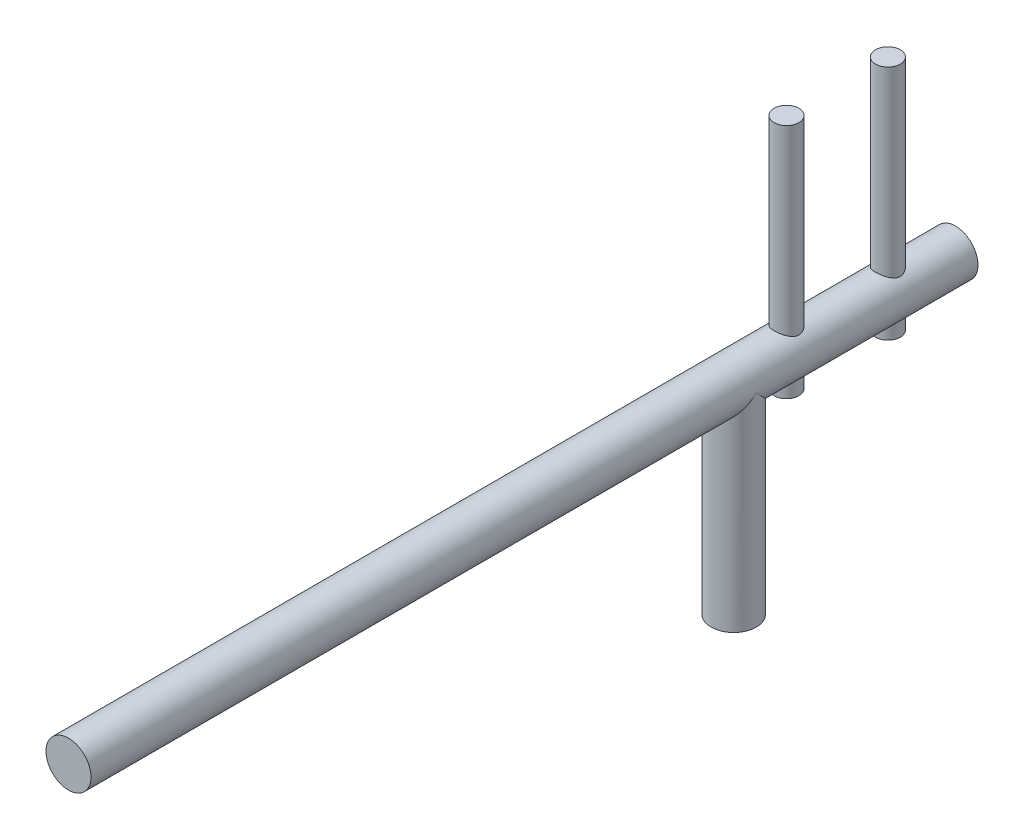
ISO-10303-21;
HEADER;
FILE_DESCRIPTION(('STEP AP214'),'2;1');
FILE_NAME('part.step','',(''),(''),'','','');
FILE_SCHEMA(('AUTOMOTIVE_DESIGN { 1 0 10303 214 1 1 1 1 }'));
ENDSEC;
DATA;
#1=APPLICATION_CONTEXT('core data for automotive mechanical design processes');
#2=APPLICATION_PROTOCOL_DEFINITION('international standard','automotive_design',2000,#1);
#3=PRODUCT_CONTEXT('',#1,'mechanical');
#4=PRODUCT('Part','Part','',(#3));
#5=PRODUCT_RELATED_PRODUCT_CATEGORY('part','',(#4));
#6=PRODUCT_DEFINITION_FORMATION('','',#4);
#7=PRODUCT_DEFINITION_CONTEXT('part definition',#1,'design');
#8=PRODUCT_DEFINITION('design','',#6,#7);
#9=PRODUCT_DEFINITION_SHAPE('','',#8);
#10=(LENGTH_UNIT() NAMED_UNIT(*) SI_UNIT(.MILLI.,.METRE.));
#11=(NAMED_UNIT(*) PLANE_ANGLE_UNIT() SI_UNIT($,.RADIAN.));
#12=(NAMED_UNIT(*) SI_UNIT($,.STERADIAN.) SOLID_ANGLE_UNIT());
#13=UNCERTAINTY_MEASURE_WITH_UNIT(LENGTH_MEASURE(1.E-05),#10,'distance_accuracy_value','');
#14=(GEOMETRIC_REPRESENTATION_CONTEXT(3) GLOBAL_UNCERTAINTY_ASSIGNED_CONTEXT((#13)) GLOBAL_UNIT_ASSIGNED_CONTEXT((#10,
#11,#12)) REPRESENTATION_CONTEXT('',''));
#15=CARTESIAN_POINT('',(0.,0.,0.));
#16=DIRECTION('',(0.,0.,1.));
#17=DIRECTION('',(1.,0.,0.));
#18=AXIS2_PLACEMENT_3D('',#15,#16,#17);
#19=CARTESIAN_POINT('',(0.,57.15,-62.5));
#20=DIRECTION('',(0.,0.,1.));
#21=DIRECTION('',(1.,0.,0.));
#22=AXIS2_PLACEMENT_3D('',#19,#20,#21);
#23=CYLINDRICAL_SURFACE('',#22,6.35);
#24=CARTESIAN_POINT('',(0.,50.8,-46.95));
#25=CARTESIAN_POINT('',(-0.0908715692650655,50.7999991567737,-46.9500009389995));
#26=CARTESIAN_POINT('',(-0.181731697508472,50.8019545048641,-46.9464575979903));
#27=CARTESIAN_POINT('',(-0.362766649607753,50.809723243964,-46.9323332392506));
#28=CARTESIAN_POINT('',(-0.452941266026175,50.8155377591691,-46.9217501708088));
#29=CARTESIAN_POINT('',(-0.631973336741831,50.8308872390812,-46.8936645175435));
#30=CARTESIAN_POINT('',(-0.720829466601679,50.8404257124032,-46.8761554069802));
#31=CARTESIAN_POINT('',(-0.896516762379255,50.8629798592824,-46.8344386337041));
#32=CARTESIAN_POINT('',(-0.983347085593751,50.8759969528055,-46.8102282353945));
#33=CARTESIAN_POINT('',(-1.23913076870998,50.9196891065004,-46.7281778522962));
#34=CARTESIAN_POINT('',(-1.40432278498033,50.9550910465571,-46.6607669370184));
#35=CARTESIAN_POINT('',(-1.7206250688063,51.0353719628869,-46.5029939874617));
#36=CARTESIAN_POINT('',(-1.87173469783096,51.0802513685912,-46.4126309131655));
#37=CARTESIAN_POINT('',(-2.16742900520663,51.1791813326395,-46.2044748630541));
#38=CARTESIAN_POINT('',(-2.31084460517596,51.2336509669716,-46.0852197575292));
#39=CARTESIAN_POINT('',(-2.57672900802229,51.3445051390309,-45.8259302426771));
#40=CARTESIAN_POINT('',(-2.69917814081619,51.4008914161083,-45.6858765482482));
#41=CARTESIAN_POINT('',(-2.93198531938029,51.5157810754329,-45.3722865882821));
#42=CARTESIAN_POINT('',(-3.03994440770345,51.5739409569855,-45.196807927411));
#43=CARTESIAN_POINT('',(-3.17822593855896,51.6523455286002,-44.9195502060432));
#44=CARTESIAN_POINT('',(-3.22038688653525,51.6770144917021,-44.824757577089));
#45=CARTESIAN_POINT('',(-3.29636638083338,51.7224384184021,-44.6310058854196));
#46=CARTESIAN_POINT('',(-3.33019032969714,51.7431959146439,-44.5320495697944));
#47=CARTESIAN_POINT('',(-3.38717389754151,51.7787234523235,-44.3369756744515));
#48=CARTESIAN_POINT('',(-3.41086820084982,51.7937867777926,-44.2410676493675));
#49=CARTESIAN_POINT('',(-3.45012570566931,51.818988951023,-44.047011103229));
#50=CARTESIAN_POINT('',(-3.46569371992469,51.8291307132987,-43.9488639443207));
#51=CARTESIAN_POINT('',(-3.48842438664218,51.8440051510909,-43.7512868975359));
#52=CARTESIAN_POINT('',(-3.49559518404216,51.8487430679878,-43.6518583473764));
#53=CARTESIAN_POINT('',(-3.50141675979025,51.8525860780392,-43.4526504752397));
#54=CARTESIAN_POINT('',(-3.50006871378545,51.8516919484471,-43.3528712035635));
#55=CARTESIAN_POINT('',(-3.48974246785789,51.844886809416,-43.1692761734268));
#56=CARTESIAN_POINT('',(-3.48196697160552,51.839766769322,-43.0853605148569));
#57=CARTESIAN_POINT('',(-3.46044849133795,51.8257201933984,-42.918610720909));
#58=CARTESIAN_POINT('',(-3.44670360088367,51.8167924415203,-42.8357769397619));
#59=CARTESIAN_POINT('',(-3.39674981346232,51.7847224889542,-42.5897458764414));
#60=CARTESIAN_POINT('',(-3.35181580050037,51.756289243044,-42.4289168197105));
#61=CARTESIAN_POINT('',(-3.23941888947869,51.6880382804285,-42.1140424379224));
#62=CARTESIAN_POINT('',(-3.17149281980342,51.6479891523636,-41.9602170212937));
#63=CARTESIAN_POINT('',(-3.01542303190014,51.5609300958458,-41.6653254285983));
#64=CARTESIAN_POINT('',(-2.92727060838179,51.5139171733181,-41.5242647829622));
#65=CARTESIAN_POINT('',(-2.71705576842523,51.4092698004812,-41.2354121207823));
#66=CARTESIAN_POINT('',(-2.5918327524731,51.3511332340649,-41.0900998302631));
#67=CARTESIAN_POINT('',(-2.31877642289221,51.2366544422758,-40.821321466817));
#68=CARTESIAN_POINT('',(-2.17092764788228,51.1803134759855,-40.6978704582562));
#69=CARTESIAN_POINT('',(-1.92893190461299,51.0994085894986,-40.5276971832272));
#70=CARTESIAN_POINT('',(-1.84182577339049,51.072261396383,-40.4720090636471));
#71=CARTESIAN_POINT('',(-1.66241629710187,51.0207616016302,-40.3682642492392));
#72=CARTESIAN_POINT('',(-1.57011535406853,50.9964077239605,-40.3202040659629));
#73=CARTESIAN_POINT('',(-1.38090917979445,50.9512056964441,-40.2322409554652));
#74=CARTESIAN_POINT('',(-1.28400511969769,50.9303566609435,-40.1923359669205));
#75=CARTESIAN_POINT('',(-1.08633952163333,50.892806147977,-40.1212032011101));
#76=CARTESIAN_POINT('',(-0.985580410749815,50.876102108907,-40.0899700632219));
#77=CARTESIAN_POINT('',(-0.790537515736702,50.8487041865581,-40.0390993281584));
#78=CARTESIAN_POINT('',(-0.696522190318285,50.837596021893,-40.0186538595114));
#79=CARTESIAN_POINT('',(-0.506782060537389,50.819538049727,-39.9855460503813));
#80=CARTESIAN_POINT('',(-0.411058167153518,50.8125860906223,-39.9728796826844));
#81=CARTESIAN_POINT('',(-0.218696933860484,50.8030373569682,-39.955505832971));
#82=CARTESIAN_POINT('',(-0.122059885905782,50.8004392348271,-39.9507958882931));
#83=CARTESIAN_POINT('',(0.0712599338227022,50.7996623655062,-39.9493884453631));
#84=CARTESIAN_POINT('',(0.167942702200155,50.8014833298663,-39.952690424125));
#85=CARTESIAN_POINT('',(0.437828656829731,50.8127412431983,-39.9731454663523));
#86=CARTESIAN_POINT('',(0.610248813545658,50.8271129065225,-39.9992795118216));
#87=CARTESIAN_POINT('',(0.947697050188379,50.8688082018238,-40.0762934278778));
#88=CARTESIAN_POINT('',(1.11272438209319,50.8961331412163,-40.1271757964051));
#89=CARTESIAN_POINT('',(1.43525888900255,50.9620906925062,-40.253023936914));
#90=CARTESIAN_POINT('',(1.59251670040076,51.0009616041946,-40.328500875479));
#91=CARTESIAN_POINT('',(1.89253356975219,51.0865683487094,-40.5007146078418));
#92=CARTESIAN_POINT('',(2.03528732843529,51.1333070396931,-40.5974591315149));
#93=CARTESIAN_POINT('',(2.31933019898976,51.2365814427362,-40.821877269622));
#94=CARTESIAN_POINT('',(2.45865675767099,51.2936279715922,-40.9518035335966));
#95=CARTESIAN_POINT('',(2.71459056697568,51.4077724494289,-41.2325297813202));
#96=CARTESIAN_POINT('',(2.8311739493973,51.4648703899228,-41.3833514132819));
#97=CARTESIAN_POINT('',(3.04735146085524,51.5775532443493,-41.7162347076106));
#98=CARTESIAN_POINT('',(3.14489542954711,51.6326681014616,-41.8998189016266));
#99=CARTESIAN_POINT('',(3.2662803539968,51.7042564225303,-42.1881294101399));
#100=CARTESIAN_POINT('',(3.30258811749467,51.7262727625594,-42.286394298342));
#101=CARTESIAN_POINT('',(3.36643579128999,51.7656691274311,-42.4866077854748));
#102=CARTESIAN_POINT('',(3.39398186455359,51.7830524097618,-42.5885537386917));
#103=CARTESIAN_POINT('',(3.43763656242808,51.8109214193422,-42.7853097809145));
#104=CARTESIAN_POINT('',(3.45459113453483,51.8219101594657,-42.8798616895644));
#105=CARTESIAN_POINT('',(3.48068562797551,51.8389199369993,-43.0704350760763));
#106=CARTESIAN_POINT('',(3.48983000038232,51.8449438038475,-43.1664556851125));
#107=CARTESIAN_POINT('',(3.50014628109462,51.8517439032451,-43.3590692272892));
#108=CARTESIAN_POINT('',(3.50132213713013,51.8525227342676,-43.4556618533));
#109=CARTESIAN_POINT('',(3.4957004739568,51.8488134541326,-43.6484816685906));
#110=CARTESIAN_POINT('',(3.48890362253218,51.8443257840908,-43.7447088877992));
#111=CARTESIAN_POINT('',(3.45965507608022,51.8251675263774,-44.0051873929285));
#112=CARTESIAN_POINT('',(3.42943414729415,51.805478183327,-44.1682741692604));
#113=CARTESIAN_POINT('',(3.34703194628885,51.753501975273,-44.4865783467586));
#114=CARTESIAN_POINT('',(3.29484157995127,51.7212098938444,-44.6417924592355));
#115=CARTESIAN_POINT('',(3.16660039245103,51.6453649797998,-44.9507648986836));
#116=CARTESIAN_POINT('',(3.08928875621209,51.6012455978731,-45.1038574214478));
#117=CARTESIAN_POINT('',(2.91417908813554,51.5073124114475,-45.3959167211817));
#118=CARTESIAN_POINT('',(2.81637020573984,51.4574955972883,-45.5348759583591));
#119=CARTESIAN_POINT('',(2.58510955057577,51.3484031118376,-45.8176213555984));
#120=CARTESIAN_POINT('',(2.44846911384937,51.2888749717927,-45.9587111315826));
#121=CARTESIAN_POINT('',(2.15234454813119,51.1737894514457,-46.216941773134));
#122=CARTESIAN_POINT('',(1.99284403526987,51.118234962248,-46.3340653146176));
#123=CARTESIAN_POINT('',(1.7359213639353,51.0411941595021,-46.4909143751095));
#124=CARTESIAN_POINT('',(1.64558999992929,51.0161844416027,-46.5407518648596));
#125=CARTESIAN_POINT('',(1.46021010995751,50.9694334911908,-46.6325252445288));
#126=CARTESIAN_POINT('',(1.3651639259494,50.9476906571451,-46.6744650087425));
#127=CARTESIAN_POINT('',(1.17118764634186,50.9081572733803,-46.7498679636681));
#128=CARTESIAN_POINT('',(1.07226535560633,50.8903592178179,-46.7833472696576));
#129=CARTESIAN_POINT('',(0.871217140430948,50.8592274107513,-46.8414483252306));
#130=CARTESIAN_POINT('',(0.769092915753881,50.8458913330427,-46.8660746906998));
#131=CARTESIAN_POINT('',(0.556588637005556,50.8234870032943,-46.9072509047874));
#132=CARTESIAN_POINT('',(0.446071448993913,50.8147081238843,-46.9232551579387));
#133=CARTESIAN_POINT('',(0.223697048749133,50.8029651905134,-46.9446290374044));
#134=CARTESIAN_POINT('',(0.111839859306466,50.8000010377977,-46.9499988443297));
#135=CARTESIAN_POINT('',(0.,50.8,-46.95));
#136=B_SPLINE_CURVE_WITH_KNOTS('',3,(#24,#25,#26,#27,#28,#29,#30,#31,#32,#33,#34,#35,#36,#37,
#38,#39,#40,#41,#42,#43,#44,#45,#46,#47,#48,#49,#50,#51,#52,#53,#54,#55,#56,#57,#58,#59,#60,#61,
#62,#63,#64,#65,#66,#67,#68,#69,#70,#71,#72,#73,#74,#75,#76,#77,#78,#79,#80,#81,#82,#83,#84,#85,
#86,#87,#88,#89,#90,#91,#92,#93,#94,#95,#96,#97,#98,#99,#100,#101,#102,#103,#104,#105,#106,#107,
#108,#109,#110,#111,#112,#113,#114,#115,#116,#117,#118,#119,#120,#121,#122,#123,#124,#125,#126,
#127,#128,#129,#130,#131,#132,#133,#134,#135),.UNSPECIFIED.,.T.,.F.,(4,2,2,2,2,2,2,2,2,2,2,2,2,
2,2,2,2,2,2,2,2,2,2,2,2,2,2,2,2,2,2,2,2,2,2,2,2,2,2,2,2,2,2,2,2,2,2,2,2,2,2,2,2,2,2,4),(0.,
0.272504959619934,0.545089336213517,0.817931156796928,1.09088452143332,1.63394236533243,
2.17702482087578,2.75756853561319,3.3386539490756,3.97729585314651,4.29682671214079,
4.6161499611356,4.91550118995625,5.21467492814202,5.51355823972369,5.81240030467087,
6.06538081042844,6.31844216978279,6.82426178254629,7.34094599015839,7.857852993795,
8.45672904033378,9.05601617330107,9.37632343786785,9.69648379308054,10.0165631235639,
10.3364441498802,10.6265971529778,10.9165998179677,11.2065127052659,11.4964066687351,
12.018668807604,12.540983671277,13.0749320298651,13.6090747780959,14.2031661285008,
14.7978776428167,15.4392417866618,15.7599586623112,16.0804494445024,16.3700782743705,
16.6595419329344,16.9488621760984,17.2381581878834,17.7367987219607,18.2356458686197,
18.7649092235023,19.2944534636918,19.907530889855,20.5210499279096,20.8391423597208,
21.1570783398288,21.4744040792534,21.7915641255838,22.1269543275007,22.4623388332454),.UNSPECIFIED.);
#137=CARTESIAN_POINT('',(0.,50.8,-46.95));
#138=VERTEX_POINT('',#137);
#139=EDGE_CURVE('E124',#138,#138,#136,.T.);
#140=ORIENTED_EDGE('',*,*,#139,.T.);
#141=EDGE_LOOP('',(#140));
#142=FACE_BOUND('',#141,.T.);
#143=CARTESIAN_POINT('',(0.,50.8,-18.375));
#144=CARTESIAN_POINT('',(-0.0908715692650657,50.7999991567737,-18.3750009389995));
#145=CARTESIAN_POINT('',(-0.181731697508473,50.8019545048641,-18.3714575979903));
#146=CARTESIAN_POINT('',(-0.362766649607753,50.809723243964,-18.3573332392506));
#147=CARTESIAN_POINT('',(-0.452941266026176,50.8155377591691,-18.3467501708088));
#148=CARTESIAN_POINT('',(-0.631973336741832,50.8308872390812,-18.3186645175435));
#149=CARTESIAN_POINT('',(-0.72082946660168,50.8404257124032,-18.3011554069802));
#150=CARTESIAN_POINT('',(-0.896516762379255,50.8629798592824,-18.2594386337041));
#151=CARTESIAN_POINT('',(-0.98334708559375,50.8759969528055,-18.2352282353945));
#152=CARTESIAN_POINT('',(-1.23913076870998,50.9196891065004,-18.1531778522962));
#153=CARTESIAN_POINT('',(-1.40432278498033,50.9550910465571,-18.0857669370184));
#154=CARTESIAN_POINT('',(-1.7206250688063,51.0353719628869,-17.9279939874617));
#155=CARTESIAN_POINT('',(-1.87173469783096,51.0802513685912,-17.8376309131655));
#156=CARTESIAN_POINT('',(-2.16742900520662,51.1791813326395,-17.6294748630541));
#157=CARTESIAN_POINT('',(-2.31084460517595,51.2336509669716,-17.5102197575292));
#158=CARTESIAN_POINT('',(-2.57672900802228,51.3445051390309,-17.2509302426771));
#159=CARTESIAN_POINT('',(-2.69917814081619,51.4008914161083,-17.1108765482482));
#160=CARTESIAN_POINT('',(-2.93198531938029,51.5157810754329,-16.7972865882821));
#161=CARTESIAN_POINT('',(-3.03994440770345,51.5739409569855,-16.621807927411));
#162=CARTESIAN_POINT('',(-3.17822593855896,51.6523455286002,-16.3445502060432));
#163=CARTESIAN_POINT('',(-3.22038688653525,51.6770144917021,-16.249757577089));
#164=CARTESIAN_POINT('',(-3.29636638083337,51.7224384184021,-16.0560058854196));
#165=CARTESIAN_POINT('',(-3.33019032969714,51.7431959146439,-15.9570495697944));
#166=CARTESIAN_POINT('',(-3.38717389754151,51.7787234523235,-15.7619756744515));
#167=CARTESIAN_POINT('',(-3.41086820084982,51.7937867777926,-15.6660676493675));
#168=CARTESIAN_POINT('',(-3.45012570566931,51.818988951023,-15.472011103229));
#169=CARTESIAN_POINT('',(-3.46569371992469,51.8291307132987,-15.3738639443207));
#170=CARTESIAN_POINT('',(-3.48842438664218,51.8440051510909,-15.1762868975359));
#171=CARTESIAN_POINT('',(-3.49559518404216,51.8487430679878,-15.0768583473763));
#172=CARTESIAN_POINT('',(-3.50141675979025,51.8525860780392,-14.8776504752397));
#173=CARTESIAN_POINT('',(-3.50006871378545,51.8516919484471,-14.7778712035635));
#174=CARTESIAN_POINT('',(-3.48974246785789,51.844886809416,-14.5942761734268));
#175=CARTESIAN_POINT('',(-3.48196697160552,51.839766769322,-14.5103605148569));
#176=CARTESIAN_POINT('',(-3.46044849133795,51.8257201933984,-14.343610720909));
#177=CARTESIAN_POINT('',(-3.44670360088367,51.8167924415203,-14.2607769397619));
#178=CARTESIAN_POINT('',(-3.39674981346232,51.7847224889542,-14.0147458764414));
#179=CARTESIAN_POINT('',(-3.35181580050037,51.756289243044,-13.8539168197105));
#180=CARTESIAN_POINT('',(-3.23941888947869,51.6880382804285,-13.5390424379224));
#181=CARTESIAN_POINT('',(-3.17149281980342,51.6479891523636,-13.3852170212937));
#182=CARTESIAN_POINT('',(-3.01542303190014,51.5609300958458,-13.0903254285983));
#183=CARTESIAN_POINT('',(-2.92727060838179,51.5139171733181,-12.9492647829622));
#184=CARTESIAN_POINT('',(-2.71705576842523,51.4092698004812,-12.6604121207823));
#185=CARTESIAN_POINT('',(-2.5918327524731,51.3511332340649,-12.5150998302631));
#186=CARTESIAN_POINT('',(-2.31877642289221,51.2366544422758,-12.246321466817));
#187=CARTESIAN_POINT('',(-2.17092764788228,51.1803134759855,-12.1228704582562));
#188=CARTESIAN_POINT('',(-1.92893190461299,51.0994085894986,-11.9526971832272));
#189=CARTESIAN_POINT('',(-1.8418257733905,51.072261396383,-11.8970090636471));
#190=CARTESIAN_POINT('',(-1.66241629710187,51.0207616016302,-11.7932642492393));
#191=CARTESIAN_POINT('',(-1.57011535406853,50.9964077239605,-11.7452040659629));
#192=CARTESIAN_POINT('',(-1.38090917979445,50.9512056964441,-11.6572409554652));
#193=CARTESIAN_POINT('',(-1.28400511969769,50.9303566609435,-11.6173359669205));
#194=CARTESIAN_POINT('',(-1.08633952163333,50.892806147977,-11.5462032011101));
#195=CARTESIAN_POINT('',(-0.985580410749816,50.876102108907,-11.5149700632219));
#196=CARTESIAN_POINT('',(-0.790537515736702,50.8487041865581,-11.4640993281585));
#197=CARTESIAN_POINT('',(-0.696522190318284,50.837596021893,-11.4436538595114));
#198=CARTESIAN_POINT('',(-0.506782060537388,50.819538049727,-11.4105460503813));
#199=CARTESIAN_POINT('',(-0.411058167153518,50.8125860906223,-11.3978796826844));
#200=CARTESIAN_POINT('',(-0.218696933860485,50.8030373569682,-11.380505832971));
#201=CARTESIAN_POINT('',(-0.122059885905782,50.8004392348271,-11.3757958882932));
#202=CARTESIAN_POINT('',(0.0712599338227024,50.7996623655062,-11.3743884453631));
#203=CARTESIAN_POINT('',(0.167942702200155,50.8014833298663,-11.377690424125));
#204=CARTESIAN_POINT('',(0.437828656829731,50.8127412431983,-11.3981454663523));
#205=CARTESIAN_POINT('',(0.61024881354566,50.8271129065225,-11.4242795118216));
#206=CARTESIAN_POINT('',(0.94769705018838,50.8688082018238,-11.5012934278778));
#207=CARTESIAN_POINT('',(1.11272438209319,50.8961331412163,-11.5521757964051));
#208=CARTESIAN_POINT('',(1.43525888900256,50.9620906925062,-11.678023936914));
#209=CARTESIAN_POINT('',(1.59251670040077,51.0009616041946,-11.753500875479));
#210=CARTESIAN_POINT('',(1.89253356975219,51.0865683487094,-11.9257146078418));
#211=CARTESIAN_POINT('',(2.03528732843529,51.1333070396931,-12.0224591315149));
#212=CARTESIAN_POINT('',(2.31933019898976,51.2365814427362,-12.246877269622));
#213=CARTESIAN_POINT('',(2.45865675767099,51.2936279715922,-12.3768035335966));
#214=CARTESIAN_POINT('',(2.71459056697568,51.4077724494289,-12.6575297813202));
#215=CARTESIAN_POINT('',(2.8311739493973,51.4648703899228,-12.8083514132819));
#216=CARTESIAN_POINT('',(3.04735146085524,51.5775532443493,-13.1412347076106));
#217=CARTESIAN_POINT('',(3.14489542954711,51.6326681014616,-13.3248189016266));
#218=CARTESIAN_POINT('',(3.26628035399679,51.7042564225303,-13.6131294101399));
#219=CARTESIAN_POINT('',(3.30258811749467,51.7262727625594,-13.711394298342));
#220=CARTESIAN_POINT('',(3.36643579128999,51.7656691274311,-13.9116077854748));
#221=CARTESIAN_POINT('',(3.39398186455359,51.7830524097618,-14.0135537386917));
#222=CARTESIAN_POINT('',(3.43763656242808,51.8109214193422,-14.2103097809144));
#223=CARTESIAN_POINT('',(3.45459113453483,51.8219101594657,-14.3048616895644));
#224=CARTESIAN_POINT('',(3.48068562797551,51.8389199369993,-14.4954350760763));
#225=CARTESIAN_POINT('',(3.48983000038231,51.8449438038475,-14.5914556851125));
#226=CARTESIAN_POINT('',(3.50014628109462,51.8517439032451,-14.7840692272892));
#227=CARTESIAN_POINT('',(3.50132213713012,51.8525227342676,-14.8806618533));
#228=CARTESIAN_POINT('',(3.49570047395679,51.8488134541326,-15.0734816685906));
#229=CARTESIAN_POINT('',(3.48890362253217,51.8443257840908,-15.1697088877992));
#230=CARTESIAN_POINT('',(3.45965507608022,51.8251675263774,-15.4301873929285));
#231=CARTESIAN_POINT('',(3.42943414729415,51.805478183327,-15.5932741692604));
#232=CARTESIAN_POINT('',(3.34703194628885,51.753501975273,-15.9115783467586));
#233=CARTESIAN_POINT('',(3.29484157995127,51.7212098938444,-16.0667924592355));
#234=CARTESIAN_POINT('',(3.16660039245103,51.6453649797998,-16.3757648986836));
#235=CARTESIAN_POINT('',(3.08928875621209,51.6012455978731,-16.5288574214478));
#236=CARTESIAN_POINT('',(2.91417908813554,51.5073124114475,-16.8209167211817));
#237=CARTESIAN_POINT('',(2.81637020573984,51.4574955972883,-16.9598759583591));
#238=CARTESIAN_POINT('',(2.58510955057576,51.3484031118376,-17.2426213555984));
#239=CARTESIAN_POINT('',(2.44846911384936,51.2888749717927,-17.3837111315826));
#240=CARTESIAN_POINT('',(2.15234454813119,51.1737894514457,-17.641941773134));
#241=CARTESIAN_POINT('',(1.99284403526987,51.1182349622479,-17.7590653146176));
#242=CARTESIAN_POINT('',(1.7359213639353,51.0411941595021,-17.9159143751095));
#243=CARTESIAN_POINT('',(1.64558999992929,51.0161844416027,-17.9657518648596));
#244=CARTESIAN_POINT('',(1.46021010995752,50.9694334911908,-18.0575252445288));
#245=CARTESIAN_POINT('',(1.3651639259494,50.9476906571451,-18.0994650087425));
#246=CARTESIAN_POINT('',(1.17118764634187,50.9081572733803,-18.1748679636681));
#247=CARTESIAN_POINT('',(1.07226535560633,50.8903592178179,-18.2083472696576));
#248=CARTESIAN_POINT('',(0.871217140430949,50.8592274107513,-18.2664483252306));
#249=CARTESIAN_POINT('',(0.769092915753882,50.8458913330427,-18.2910746906998));
#250=CARTESIAN_POINT('',(0.556588637005556,50.8234870032943,-18.3322509047874));
#251=CARTESIAN_POINT('',(0.446071448993914,50.8147081238843,-18.3482551579387));
#252=CARTESIAN_POINT('',(0.223697048749133,50.8029651905134,-18.3696290374044));
#253=CARTESIAN_POINT('',(0.111839859306466,50.8000010377977,-18.3749988443297));
#254=CARTESIAN_POINT('',(0.,50.8,-18.375));
#255=B_SPLINE_CURVE_WITH_KNOTS('',3,(#143,#144,#145,#146,#147,#148,#149,#150,#151,#152,#153,
#154,#155,#156,#157,#158,#159,#160,#161,#162,#163,#164,#165,#166,#167,#168,#169,#170,#171,#172,
#173,#174,#175,#176,#177,#178,#179,#180,#181,#182,#183,#184,#185,#186,#187,#188,#189,#190,#191,
#192,#193,#194,#195,#196,#197,#198,#199,#200,#201,#202,#203,#204,#205,#206,#207,#208,#209,#210,
#211,#212,#213,#214,#215,#216,#217,#218,#219,#220,#221,#222,#223,#224,#225,#226,#227,#228,#229,
#230,#231,#232,#233,#234,#235,#236,#237,#238,#239,#240,#241,#242,#243,#244,#245,#246,#247,#248,
#249,#250,#251,#252,#253,#254),.UNSPECIFIED.,.T.,.F.,(4,2,2,2,2,2,2,2,2,2,2,2,2,2,2,2,2,2,2,2,2,
2,2,2,2,2,2,2,2,2,2,2,2,2,2,2,2,2,2,2,2,2,2,2,2,2,2,2,2,2,2,2,2,2,2,4),(0.,0.272504959619935,
0.545089336213517,0.817931156796928,1.09088452143332,1.63394236533243,2.17702482087578,
2.75756853561319,3.33865394907559,3.97729585314651,4.29682671214079,4.61614996113561,
4.91550118995625,5.21467492814202,5.51355823972369,5.81240030467087,6.06538081042843,
6.31844216978279,6.82426178254629,7.34094599015839,7.857852993795,8.45672904033377,
9.05601617330106,9.37632343786784,9.69648379308053,10.0165631235639,10.3364441498802,
10.6265971529778,10.9165998179677,11.2065127052659,11.4964066687351,12.018668807604,
12.5409836712769,13.0749320298651,13.6090747780959,14.2031661285008,14.7978776428167,
15.4392417866618,15.7599586623112,16.0804494445024,16.3700782743705,16.6595419329344,
16.9488621760984,17.2381581878834,17.7367987219607,18.2356458686197,18.7649092235023,
19.2944534636918,19.907530889855,20.5210499279096,20.8391423597208,21.1570783398288,
21.4744040792533,21.7915641255837,22.1269543275007,22.4623388332454),.UNSPECIFIED.);
#256=CARTESIAN_POINT('',(0.,50.8,-18.375));
#257=VERTEX_POINT('',#256);
#258=EDGE_CURVE('E75',#257,#257,#255,.T.);
#259=ORIENTED_EDGE('',*,*,#258,.T.);
#260=EDGE_LOOP('',(#259));
#261=FACE_BOUND('',#260,.T.);
#262=CARTESIAN_POINT('',(0.,57.15,187.5));
#263=DIRECTION('',(0.,0.,1.));
#264=DIRECTION('',(1.,0.,0.));
#265=AXIS2_PLACEMENT_3D('',#262,#263,#264);
#266=CIRCLE('',#265,6.35);
#267=CARTESIAN_POINT('',(6.35,57.15,187.5));
#268=VERTEX_POINT('',#267);
#269=EDGE_CURVE('E110',#268,#268,#266,.T.);
#270=ORIENTED_EDGE('',*,*,#269,.F.);
#271=EDGE_LOOP('',(#270));
#272=FACE_BOUND('',#271,.T.);
#273=CARTESIAN_POINT('',(0.,57.15,-62.5));
#274=DIRECTION('',(0.,0.,1.));
#275=DIRECTION('',(1.,0.,0.));
#276=AXIS2_PLACEMENT_3D('',#273,#274,#275);
#277=CIRCLE('',#276,6.35);
#278=CARTESIAN_POINT('',(6.35,57.15,-62.5));
#279=VERTEX_POINT('',#278);
#280=EDGE_CURVE('E69',#279,#279,#277,.T.);
#281=ORIENTED_EDGE('',*,*,#280,.T.);
#282=EDGE_LOOP('',(#281));
#283=FACE_BOUND('',#282,.T.);
#284=CARTESIAN_POINT('',(0.,57.15,0.));
#285=DIRECTION('',(0.,-0.707106781186547,0.707106781186547));
#286=DIRECTION('',(0.,-0.707106781186547,-0.707106781186547));
#287=AXIS2_PLACEMENT_3D('',#284,#285,#286);
#288=ELLIPSE('',#287,8.98025612106915,6.35);
#289=CARTESIAN_POINT('',(-6.35,57.15,0.));
#290=VERTEX_POINT('',#289);
#291=CARTESIAN_POINT('',(6.35,57.15,0.));
#292=VERTEX_POINT('',#291);
#293=EDGE_CURVE('E58',#290,#292,#288,.T.);
#294=ORIENTED_EDGE('',*,*,#293,.F.);
#295=CARTESIAN_POINT('',(0.,57.15,0.));
#296=DIRECTION('',(0.,-0.707106781186547,-0.707106781186547));
#297=DIRECTION('',(0.,-0.707106781186547,0.707106781186547));
#298=AXIS2_PLACEMENT_3D('',#295,#296,#297);
#299=ELLIPSE('',#298,8.98025612106915,6.35);
#300=EDGE_CURVE('E66',#292,#290,#299,.T.);
#301=ORIENTED_EDGE('',*,*,#300,.F.);
#302=EDGE_LOOP('',(#294,#301));
#303=FACE_BOUND('',#302,.T.);
#304=CARTESIAN_POINT('',(0.,63.5,-18.375));
#305=CARTESIAN_POINT('',(0.090871569265066,63.5000008432263,-18.3750009389995));
#306=CARTESIAN_POINT('',(0.181731697508473,63.4980454951359,-18.3714575979903));
#307=CARTESIAN_POINT('',(0.362766649607754,63.490276756036,-18.3573332392506));
#308=CARTESIAN_POINT('',(0.452941266026176,63.4844622408309,-18.3467501708088));
#309=CARTESIAN_POINT('',(0.631973336741832,63.4691127609187,-18.3186645175435));
#310=CARTESIAN_POINT('',(0.720829466601681,63.4595742875968,-18.3011554069802));
#311=CARTESIAN_POINT('',(0.896516762379256,63.4370201407176,-18.2594386337041));
#312=CARTESIAN_POINT('',(0.983347085593751,63.4240030471945,-18.2352282353945));
#313=CARTESIAN_POINT('',(1.23913076870998,63.3803108934996,-18.1531778522962));
#314=CARTESIAN_POINT('',(1.40432278498033,63.3449089534429,-18.0857669370184));
#315=CARTESIAN_POINT('',(1.7206250688063,63.2646280371131,-17.9279939874617));
#316=CARTESIAN_POINT('',(1.87173469783096,63.2197486314088,-17.8376309131655));
#317=CARTESIAN_POINT('',(2.16742900520663,63.1208186673605,-17.6294748630541));
#318=CARTESIAN_POINT('',(2.31084460517596,63.0663490330284,-17.5102197575292));
#319=CARTESIAN_POINT('',(2.57672900802229,62.9554948609691,-17.2509302426771));
#320=CARTESIAN_POINT('',(2.69917814081619,62.8991085838917,-17.1108765482482));
#321=CARTESIAN_POINT('',(2.93198531938029,62.7842189245671,-16.7972865882821));
#322=CARTESIAN_POINT('',(3.03994440770345,62.7260590430145,-16.621807927411));
#323=CARTESIAN_POINT('',(3.17822593855896,62.6476544713998,-16.3445502060432));
#324=CARTESIAN_POINT('',(3.22038688653524,62.6229855082979,-16.249757577089));
#325=CARTESIAN_POINT('',(3.29636638083337,62.5775615815979,-16.0560058854196));
#326=CARTESIAN_POINT('',(3.33019032969714,62.5568040853561,-15.9570495697944));
#327=CARTESIAN_POINT('',(3.38717389754151,62.5212765476765,-15.7619756744515));
#328=CARTESIAN_POINT('',(3.41086820084982,62.5062132222074,-15.6660676493675));
#329=CARTESIAN_POINT('',(3.45012570566931,62.481011048977,-15.472011103229));
#330=CARTESIAN_POINT('',(3.46569371992469,62.4708692867013,-15.3738639443207));
#331=CARTESIAN_POINT('',(3.48842438664218,62.4559948489091,-15.1762868975359));
#332=CARTESIAN_POINT('',(3.49559518404216,62.4512569320122,-15.0768583473763));
#333=CARTESIAN_POINT('',(3.50141675979025,62.4474139219608,-14.8776504752397));
#334=CARTESIAN_POINT('',(3.50006871378545,62.4483080515529,-14.7778712035635));
#335=CARTESIAN_POINT('',(3.48974246785789,62.455113190584,-14.5942761734268));
#336=CARTESIAN_POINT('',(3.48196697160552,62.460233230678,-14.5103605148569));
#337=CARTESIAN_POINT('',(3.46044849133795,62.4742798066016,-14.343610720909));
#338=CARTESIAN_POINT('',(3.44670360088367,62.4832075584797,-14.2607769397619));
#339=CARTESIAN_POINT('',(3.39674981346232,62.5152775110458,-14.0147458764414));
#340=CARTESIAN_POINT('',(3.35181580050037,62.543710756956,-13.8539168197105));
#341=CARTESIAN_POINT('',(3.23941888947869,62.6119617195715,-13.5390424379224));
#342=CARTESIAN_POINT('',(3.17149281980342,62.6520108476364,-13.3852170212937));
#343=CARTESIAN_POINT('',(3.01542303190014,62.7390699041542,-13.0903254285983));
#344=CARTESIAN_POINT('',(2.92727060838179,62.7860828266819,-12.9492647829622));
#345=CARTESIAN_POINT('',(2.71705576842524,62.8907301995188,-12.6604121207823));
#346=CARTESIAN_POINT('',(2.5918327524731,62.9488667659351,-12.5150998302631));
#347=CARTESIAN_POINT('',(2.31877642289221,63.0633455577242,-12.246321466817));
#348=CARTESIAN_POINT('',(2.17092764788228,63.1196865240145,-12.1228704582562));
#349=CARTESIAN_POINT('',(1.92893190461299,63.2005914105014,-11.9526971832272));
#350=CARTESIAN_POINT('',(1.8418257733905,63.227738603617,-11.8970090636471));
#351=CARTESIAN_POINT('',(1.66241629710187,63.2792383983698,-11.7932642492393));
#352=CARTESIAN_POINT('',(1.57011535406853,63.3035922760395,-11.7452040659629));
#353=CARTESIAN_POINT('',(1.38090917979445,63.3487943035559,-11.6572409554652));
#354=CARTESIAN_POINT('',(1.28400511969768,63.3696433390565,-11.6173359669205));
#355=CARTESIAN_POINT('',(1.08633952163332,63.407193852023,-11.5462032011101));
#356=CARTESIAN_POINT('',(0.985580410749812,63.423897891093,-11.5149700632219));
#357=CARTESIAN_POINT('',(0.790537515736699,63.4512958134419,-11.4640993281585));
#358=CARTESIAN_POINT('',(0.696522190318281,63.462403978107,-11.4436538595114));
#359=CARTESIAN_POINT('',(0.506782060537384,63.4804619502731,-11.4105460503813));
#360=CARTESIAN_POINT('',(0.411058167153515,63.4874139093777,-11.3978796826844));
#361=CARTESIAN_POINT('',(0.218696933860482,63.4969626430318,-11.380505832971));
#362=CARTESIAN_POINT('',(0.12205988590578,63.4995607651729,-11.3757958882932));
#363=CARTESIAN_POINT('',(-0.0712599338227042,63.5003376344938,-11.3743884453631));
#364=CARTESIAN_POINT('',(-0.167942702200157,63.4985166701337,-11.377690424125));
#365=CARTESIAN_POINT('',(-0.437828656829732,63.4872587568017,-11.3981454663523));
#366=CARTESIAN_POINT('',(-0.61024881354566,63.4728870934775,-11.4242795118216));
#367=CARTESIAN_POINT('',(-0.94769705018838,63.4311917981762,-11.5012934278778));
#368=CARTESIAN_POINT('',(-1.11272438209319,63.4038668587837,-11.5521757964051));
#369=CARTESIAN_POINT('',(-1.43525888900256,63.3379093074938,-11.678023936914));
#370=CARTESIAN_POINT('',(-1.59251670040077,63.2990383958054,-11.753500875479));
#371=CARTESIAN_POINT('',(-1.89253356975219,63.2134316512906,-11.9257146078418));
#372=CARTESIAN_POINT('',(-2.03528732843528,63.1666929603069,-12.0224591315149));
#373=CARTESIAN_POINT('',(-2.31933019898976,63.0634185572638,-12.246877269622));
#374=CARTESIAN_POINT('',(-2.45865675767099,63.0063720284078,-12.3768035335966));
#375=CARTESIAN_POINT('',(-2.71459056697568,62.8922275505711,-12.6575297813202));
#376=CARTESIAN_POINT('',(-2.8311739493973,62.8351296100772,-12.8083514132819));
#377=CARTESIAN_POINT('',(-3.04735146085524,62.7224467556508,-13.1412347076106));
#378=CARTESIAN_POINT('',(-3.14489542954711,62.6673318985384,-13.3248189016266));
#379=CARTESIAN_POINT('',(-3.2662803539968,62.5957435774697,-13.6131294101399));
#380=CARTESIAN_POINT('',(-3.30258811749467,62.5737272374406,-13.711394298342));
#381=CARTESIAN_POINT('',(-3.36643579128999,62.5343308725689,-13.9116077854748));
#382=CARTESIAN_POINT('',(-3.39398186455359,62.5169475902382,-14.0135537386917));
#383=CARTESIAN_POINT('',(-3.43763656242808,62.4890785806578,-14.2103097809145));
#384=CARTESIAN_POINT('',(-3.45459113453483,62.4780898405343,-14.3048616895644));
#385=CARTESIAN_POINT('',(-3.48068562797551,62.4610800630007,-14.4954350760763));
#386=CARTESIAN_POINT('',(-3.48983000038231,62.4550561961525,-14.5914556851125));
#387=CARTESIAN_POINT('',(-3.50014628109462,62.4482560967549,-14.7840692272892));
#388=CARTESIAN_POINT('',(-3.50132213713012,62.4474772657324,-14.8806618533));
#389=CARTESIAN_POINT('',(-3.49570047395679,62.4511865458674,-15.0734816685906));
#390=CARTESIAN_POINT('',(-3.48890362253217,62.4556742159092,-15.1697088877992));
#391=CARTESIAN_POINT('',(-3.45965507608022,62.4748324736226,-15.4301873929285));
#392=CARTESIAN_POINT('',(-3.42943414729415,62.494521816673,-15.5932741692604));
#393=CARTESIAN_POINT('',(-3.34703194628885,62.546498024727,-15.9115783467586));
#394=CARTESIAN_POINT('',(-3.29484157995127,62.5787901061556,-16.0667924592355));
#395=CARTESIAN_POINT('',(-3.16660039245103,62.6546350202002,-16.3757648986836));
#396=CARTESIAN_POINT('',(-3.08928875621209,62.6987544021269,-16.5288574214478));
#397=CARTESIAN_POINT('',(-2.91417908813554,62.7926875885525,-16.8209167211817));
#398=CARTESIAN_POINT('',(-2.81637020573984,62.8425044027117,-16.9598759583591));
#399=CARTESIAN_POINT('',(-2.58510955057576,62.9515968881624,-17.2426213555984));
#400=CARTESIAN_POINT('',(-2.44846911384936,63.0111250282073,-17.3837111315826));
#401=CARTESIAN_POINT('',(-2.15234454813119,63.1262105485543,-17.641941773134));
#402=CARTESIAN_POINT('',(-1.99284403526987,63.181765037752,-17.7590653146176));
#403=CARTESIAN_POINT('',(-1.7359213639353,63.2588058404979,-17.9159143751095));
#404=CARTESIAN_POINT('',(-1.64558999992929,63.2838155583973,-17.9657518648596));
#405=CARTESIAN_POINT('',(-1.46021010995751,63.3305665088092,-18.0575252445288));
#406=CARTESIAN_POINT('',(-1.3651639259494,63.3523093428549,-18.0994650087425));
#407=CARTESIAN_POINT('',(-1.17118764634186,63.3918427266197,-18.1748679636681));
#408=CARTESIAN_POINT('',(-1.07226535560633,63.4096407821821,-18.2083472696576));
#409=CARTESIAN_POINT('',(-0.871217140430947,63.4407725892487,-18.2664483252306));
#410=CARTESIAN_POINT('',(-0.76909291575388,63.4541086669573,-18.2910746906998));
#411=CARTESIAN_POINT('',(-0.556588637005555,63.4765129967057,-18.3322509047874));
#412=CARTESIAN_POINT('',(-0.446071448993914,63.4852918761157,-18.3482551579387));
#413=CARTESIAN_POINT('',(-0.223697048749134,63.4970348094866,-18.3696290374044));
#414=CARTESIAN_POINT('',(-0.111839859306466,63.4999989622023,-18.3749988443297));
#415=CARTESIAN_POINT('',(0.,63.5,-18.375));
#416=B_SPLINE_CURVE_WITH_KNOTS('',3,(#304,#305,#306,#307,#308,#309,#310,#311,#312,#313,#314,
#315,#316,#317,#318,#319,#320,#321,#322,#323,#324,#325,#326,#327,#328,#329,#330,#331,#332,#333,
#334,#335,#336,#337,#338,#339,#340,#341,#342,#343,#344,#345,#346,#347,#348,#349,#350,#351,#352,
#353,#354,#355,#356,#357,#358,#359,#360,#361,#362,#363,#364,#365,#366,#367,#368,#369,#370,#371,
#372,#373,#374,#375,#376,#377,#378,#379,#380,#381,#382,#383,#384,#385,#386,#387,#388,#389,#390,
#391,#392,#393,#394,#395,#396,#397,#398,#399,#400,#401,#402,#403,#404,#405,#406,#407,#408,#409,
#410,#411,#412,#413,#414,#415),.UNSPECIFIED.,.T.,.F.,(4,2,2,2,2,2,2,2,2,2,2,2,2,2,2,2,2,2,2,2,2,
2,2,2,2,2,2,2,2,2,2,2,2,2,2,2,2,2,2,2,2,2,2,2,2,2,2,2,2,2,2,2,2,2,2,4),(0.,0.272504959619935,
0.545089336213518,0.81793115679693,1.09088452143332,1.63394236533243,2.17702482087578,
2.75756853561319,3.33865394907559,3.97729585314651,4.29682671214078,4.61614996113561,
4.91550118995625,5.21467492814202,5.51355823972369,5.81240030467087,6.06538081042844,
6.31844216978279,6.82426178254629,7.3409459901584,7.857852993795,8.45672904033377,
9.05601617330106,9.37632343786785,9.69648379308054,10.0165631235639,10.3364441498802,
10.6265971529778,10.9165998179677,11.2065127052659,11.4964066687351,12.018668807604,
12.540983671277,13.0749320298651,13.6090747780959,14.2031661285008,14.7978776428167,
15.4392417866618,15.7599586623112,16.0804494445024,16.3700782743705,16.6595419329344,
16.9488621760984,17.2381581878834,17.7367987219607,18.2356458686197,18.7649092235023,
19.2944534636918,19.907530889855,20.5210499279096,20.8391423597208,21.1570783398288,
21.4744040792534,21.7915641255837,22.1269543275007,22.4623388332454),.UNSPECIFIED.);
#417=CARTESIAN_POINT('',(0.,63.5,-18.375));
#418=VERTEX_POINT('',#417);
#419=EDGE_CURVE('E81',#418,#418,#416,.T.);
#420=ORIENTED_EDGE('',*,*,#419,.T.);
#421=EDGE_LOOP('',(#420));
#422=FACE_BOUND('',#421,.T.);
#423=CARTESIAN_POINT('',(0.,63.5,-46.95));
#424=CARTESIAN_POINT('',(0.090871569265066,63.5000008432263,-46.9500009389995));
#425=CARTESIAN_POINT('',(0.181731697508473,63.4980454951359,-46.9464575979903));
#426=CARTESIAN_POINT('',(0.362766649607753,63.490276756036,-46.9323332392506));
#427=CARTESIAN_POINT('',(0.452941266026175,63.4844622408309,-46.9217501708088));
#428=CARTESIAN_POINT('',(0.631973336741832,63.4691127609187,-46.8936645175435));
#429=CARTESIAN_POINT('',(0.720829466601681,63.4595742875968,-46.8761554069802));
#430=CARTESIAN_POINT('',(0.896516762379256,63.4370201407176,-46.8344386337041));
#431=CARTESIAN_POINT('',(0.983347085593751,63.4240030471945,-46.8102282353945));
#432=CARTESIAN_POINT('',(1.23913076870998,63.3803108934996,-46.7281778522962));
#433=CARTESIAN_POINT('',(1.40432278498033,63.3449089534429,-46.6607669370184));
#434=CARTESIAN_POINT('',(1.72062506880631,63.2646280371131,-46.5029939874617));
#435=CARTESIAN_POINT('',(1.87173469783096,63.2197486314088,-46.4126309131655));
#436=CARTESIAN_POINT('',(2.16742900520663,63.1208186673605,-46.2044748630541));
#437=CARTESIAN_POINT('',(2.31084460517596,63.0663490330284,-46.0852197575292));
#438=CARTESIAN_POINT('',(2.57672900802229,62.9554948609691,-45.8259302426771));
#439=CARTESIAN_POINT('',(2.69917814081619,62.8991085838917,-45.6858765482482));
#440=CARTESIAN_POINT('',(2.93198531938029,62.7842189245671,-45.3722865882821));
#441=CARTESIAN_POINT('',(3.03994440770345,62.7260590430145,-45.196807927411));
#442=CARTESIAN_POINT('',(3.17822593855896,62.6476544713998,-44.9195502060432));
#443=CARTESIAN_POINT('',(3.22038688653525,62.6229855082979,-44.824757577089));
#444=CARTESIAN_POINT('',(3.29636638083338,62.5775615815979,-44.6310058854196));
#445=CARTESIAN_POINT('',(3.33019032969714,62.5568040853561,-44.5320495697944));
#446=CARTESIAN_POINT('',(3.38717389754151,62.5212765476765,-44.3369756744514));
#447=CARTESIAN_POINT('',(3.41086820084982,62.5062132222074,-44.2410676493675));
#448=CARTESIAN_POINT('',(3.45012570566931,62.481011048977,-44.047011103229));
#449=CARTESIAN_POINT('',(3.46569371992469,62.4708692867013,-43.9488639443207));
#450=CARTESIAN_POINT('',(3.48842438664218,62.4559948489091,-43.7512868975359));
#451=CARTESIAN_POINT('',(3.49559518404216,62.4512569320122,-43.6518583473764));
#452=CARTESIAN_POINT('',(3.50141675979025,62.4474139219608,-43.4526504752397));
#453=CARTESIAN_POINT('',(3.50006871378545,62.4483080515529,-43.3528712035635));
#454=CARTESIAN_POINT('',(3.48974246785789,62.455113190584,-43.1692761734268));
#455=CARTESIAN_POINT('',(3.48196697160552,62.460233230678,-43.0853605148569));
#456=CARTESIAN_POINT('',(3.46044849133795,62.4742798066016,-42.918610720909));
#457=CARTESIAN_POINT('',(3.44670360088367,62.4832075584797,-42.8357769397619));
#458=CARTESIAN_POINT('',(3.39674981346232,62.5152775110458,-42.5897458764414));
#459=CARTESIAN_POINT('',(3.35181580050037,62.543710756956,-42.4289168197105));
#460=CARTESIAN_POINT('',(3.23941888947869,62.6119617195715,-42.1140424379224));
#461=CARTESIAN_POINT('',(3.17149281980342,62.6520108476364,-41.9602170212937));
#462=CARTESIAN_POINT('',(3.01542303190014,62.7390699041542,-41.6653254285983));
#463=CARTESIAN_POINT('',(2.9272706083818,62.7860828266819,-41.5242647829622));
#464=CARTESIAN_POINT('',(2.71705576842524,62.8907301995188,-41.2354121207823));
#465=CARTESIAN_POINT('',(2.5918327524731,62.9488667659351,-41.0900998302631));
#466=CARTESIAN_POINT('',(2.31877642289222,63.0633455577242,-40.821321466817));
#467=CARTESIAN_POINT('',(2.17092764788228,63.1196865240145,-40.6978704582562));
#468=CARTESIAN_POINT('',(1.92893190461299,63.2005914105014,-40.5276971832272));
#469=CARTESIAN_POINT('',(1.8418257733905,63.227738603617,-40.4720090636471));
#470=CARTESIAN_POINT('',(1.66241629710187,63.2792383983698,-40.3682642492392));
#471=CARTESIAN_POINT('',(1.57011535406853,63.3035922760395,-40.3202040659629));
#472=CARTESIAN_POINT('',(1.38090917979445,63.3487943035559,-40.2322409554652));
#473=CARTESIAN_POINT('',(1.28400511969768,63.3696433390565,-40.1923359669205));
#474=CARTESIAN_POINT('',(1.08633952163332,63.407193852023,-40.1212032011101));
#475=CARTESIAN_POINT('',(0.985580410749812,63.423897891093,-40.0899700632219));
#476=CARTESIAN_POINT('',(0.790537515736701,63.4512958134419,-40.0390993281584));
#477=CARTESIAN_POINT('',(0.696522190318283,63.462403978107,-40.0186538595114));
#478=CARTESIAN_POINT('',(0.506782060537386,63.4804619502731,-39.9855460503813));
#479=CARTESIAN_POINT('',(0.411058167153515,63.4874139093777,-39.9728796826844));
#480=CARTESIAN_POINT('',(0.218696933860482,63.4969626430318,-39.955505832971));
#481=CARTESIAN_POINT('',(0.122059885905778,63.4995607651729,-39.9507958882931));
#482=CARTESIAN_POINT('',(-0.0712599338227058,63.5003376344938,-39.9493884453631));
#483=CARTESIAN_POINT('',(-0.167942702200158,63.4985166701337,-39.952690424125));
#484=CARTESIAN_POINT('',(-0.437828656829735,63.4872587568017,-39.9731454663523));
#485=CARTESIAN_POINT('',(-0.610248813545664,63.4728870934775,-39.9992795118216));
#486=CARTESIAN_POINT('',(-0.947697050188384,63.4311917981762,-40.0762934278778));
#487=CARTESIAN_POINT('',(-1.11272438209319,63.4038668587837,-40.1271757964051));
#488=CARTESIAN_POINT('',(-1.43525888900256,63.3379093074938,-40.253023936914));
#489=CARTESIAN_POINT('',(-1.59251670040077,63.2990383958054,-40.328500875479));
#490=CARTESIAN_POINT('',(-1.89253356975219,63.2134316512906,-40.5007146078418));
#491=CARTESIAN_POINT('',(-2.03528732843529,63.1666929603069,-40.5974591315149));
#492=CARTESIAN_POINT('',(-2.31933019898976,63.0634185572639,-40.821877269622));
#493=CARTESIAN_POINT('',(-2.45865675767098,63.0063720284078,-40.9518035335966));
#494=CARTESIAN_POINT('',(-2.71459056697567,62.8922275505711,-41.2325297813202));
#495=CARTESIAN_POINT('',(-2.83117394939729,62.8351296100772,-41.3833514132819));
#496=CARTESIAN_POINT('',(-3.04735146085524,62.7224467556508,-41.7162347076106));
#497=CARTESIAN_POINT('',(-3.14489542954711,62.6673318985384,-41.8998189016266));
#498=CARTESIAN_POINT('',(-3.26628035399679,62.5957435774697,-42.1881294101399));
#499=CARTESIAN_POINT('',(-3.30258811749467,62.5737272374406,-42.286394298342));
#500=CARTESIAN_POINT('',(-3.36643579128999,62.5343308725689,-42.4866077854748));
#501=CARTESIAN_POINT('',(-3.39398186455359,62.5169475902382,-42.5885537386917));
#502=CARTESIAN_POINT('',(-3.43763656242808,62.4890785806578,-42.7853097809145));
#503=CARTESIAN_POINT('',(-3.45459113453483,62.4780898405343,-42.8798616895644));
#504=CARTESIAN_POINT('',(-3.48068562797551,62.4610800630007,-43.0704350760763));
#505=CARTESIAN_POINT('',(-3.48983000038232,62.4550561961525,-43.1664556851125));
#506=CARTESIAN_POINT('',(-3.50014628109462,62.4482560967549,-43.3590692272892));
#507=CARTESIAN_POINT('',(-3.50132213713013,62.4474772657324,-43.4556618533));
#508=CARTESIAN_POINT('',(-3.4957004739568,62.4511865458674,-43.6484816685906));
#509=CARTESIAN_POINT('',(-3.48890362253217,62.4556742159092,-43.7447088877992));
#510=CARTESIAN_POINT('',(-3.45965507608022,62.4748324736226,-44.0051873929285));
#511=CARTESIAN_POINT('',(-3.42943414729415,62.494521816673,-44.1682741692604));
#512=CARTESIAN_POINT('',(-3.34703194628885,62.546498024727,-44.4865783467586));
#513=CARTESIAN_POINT('',(-3.29484157995127,62.5787901061556,-44.6417924592355));
#514=CARTESIAN_POINT('',(-3.16660039245103,62.6546350202002,-44.9507648986836));
#515=CARTESIAN_POINT('',(-3.08928875621209,62.6987544021269,-45.1038574214478));
#516=CARTESIAN_POINT('',(-2.91417908813554,62.7926875885525,-45.3959167211817));
#517=CARTESIAN_POINT('',(-2.81637020573984,62.8425044027117,-45.5348759583591));
#518=CARTESIAN_POINT('',(-2.58510955057576,62.9515968881624,-45.8176213555984));
#519=CARTESIAN_POINT('',(-2.44846911384936,63.0111250282073,-45.9587111315826));
#520=CARTESIAN_POINT('',(-2.15234454813119,63.1262105485543,-46.216941773134));
#521=CARTESIAN_POINT('',(-1.99284403526987,63.181765037752,-46.3340653146176));
#522=CARTESIAN_POINT('',(-1.7359213639353,63.2588058404979,-46.4909143751095));
#523=CARTESIAN_POINT('',(-1.64558999992929,63.2838155583973,-46.5407518648596));
#524=CARTESIAN_POINT('',(-1.46021010995751,63.3305665088092,-46.6325252445288));
#525=CARTESIAN_POINT('',(-1.3651639259494,63.3523093428549,-46.6744650087425));
#526=CARTESIAN_POINT('',(-1.17118764634186,63.3918427266197,-46.7498679636681));
#527=CARTESIAN_POINT('',(-1.07226535560633,63.4096407821821,-46.7833472696576));
#528=CARTESIAN_POINT('',(-0.871217140430947,63.4407725892487,-46.8414483252306));
#529=CARTESIAN_POINT('',(-0.769092915753879,63.4541086669573,-46.8660746906998));
#530=CARTESIAN_POINT('',(-0.556588637005553,63.4765129967057,-46.9072509047874));
#531=CARTESIAN_POINT('',(-0.446071448993912,63.4852918761157,-46.9232551579387));
#532=CARTESIAN_POINT('',(-0.223697048749133,63.4970348094866,-46.9446290374044));
#533=CARTESIAN_POINT('',(-0.111839859306465,63.4999989622023,-46.9499988443297));
#534=CARTESIAN_POINT('',(0.,63.5,-46.95));
#535=B_SPLINE_CURVE_WITH_KNOTS('',3,(#423,#424,#425,#426,#427,#428,#429,#430,#431,#432,#433,
#434,#435,#436,#437,#438,#439,#440,#441,#442,#443,#444,#445,#446,#447,#448,#449,#450,#451,#452,
#453,#454,#455,#456,#457,#458,#459,#460,#461,#462,#463,#464,#465,#466,#467,#468,#469,#470,#471,
#472,#473,#474,#475,#476,#477,#478,#479,#480,#481,#482,#483,#484,#485,#486,#487,#488,#489,#490,
#491,#492,#493,#494,#495,#496,#497,#498,#499,#500,#501,#502,#503,#504,#505,#506,#507,#508,#509,
#510,#511,#512,#513,#514,#515,#516,#517,#518,#519,#520,#521,#522,#523,#524,#525,#526,#527,#528,
#529,#530,#531,#532,#533,#534),.UNSPECIFIED.,.T.,.F.,(4,2,2,2,2,2,2,2,2,2,2,2,2,2,2,2,2,2,2,2,2,
2,2,2,2,2,2,2,2,2,2,2,2,2,2,2,2,2,2,2,2,2,2,2,2,2,2,2,2,2,2,2,2,2,2,4),(0.,0.272504959619935,
0.545089336213518,0.817931156796929,1.09088452143332,1.63394236533243,2.17702482087578,
2.75756853561319,3.33865394907559,3.97729585314651,4.29682671214079,4.61614996113561,
4.91550118995625,5.21467492814202,5.51355823972369,5.81240030467087,6.06538081042844,
6.31844216978279,6.82426178254629,7.34094599015839,7.85785299379501,8.45672904033377,
9.05601617330106,9.37632343786785,9.69648379308054,10.0165631235639,10.3364441498802,
10.6265971529778,10.9165998179677,11.2065127052659,11.4964066687351,12.018668807604,
12.540983671277,13.0749320298651,13.6090747780959,14.2031661285008,14.7978776428167,
15.4392417866618,15.7599586623112,16.0804494445024,16.3700782743705,16.6595419329344,
16.9488621760984,17.2381581878834,17.7367987219607,18.2356458686197,18.7649092235023,
19.2944534636918,19.907530889855,20.5210499279096,20.8391423597208,21.1570783398288,
21.4744040792534,21.7915641255837,22.1269543275007,22.4623388332454),.UNSPECIFIED.);
#536=CARTESIAN_POINT('',(0.,63.5,-46.95));
#537=VERTEX_POINT('',#536);
#538=EDGE_CURVE('E49',#537,#537,#535,.T.);
#539=ORIENTED_EDGE('',*,*,#538,.T.);
#540=EDGE_LOOP('',(#539));
#541=FACE_BOUND('',#540,.T.);
#542=ADVANCED_FACE('F45',(#142,#261,#272,#283,#303,#422,#541),#23,.T.);
#543=CARTESIAN_POINT('',(0.,57.15,-62.5));
#544=DIRECTION('',(0.,0.,1.));
#545=DIRECTION('',(1.,0.,0.));
#546=AXIS2_PLACEMENT_3D('',#543,#544,#545);
#547=PLANE('',#546);
#548=ORIENTED_EDGE('',*,*,#280,.F.);
#549=EDGE_LOOP('',(#548));
#550=FACE_BOUND('',#549,.T.);
#551=ADVANCED_FACE('F99',(#550),#547,.F.);
#552=CARTESIAN_POINT('',(0.,57.15,187.5));
#553=DIRECTION('',(0.,0.,1.));
#554=DIRECTION('',(1.,0.,0.));
#555=AXIS2_PLACEMENT_3D('',#552,#553,#554);
#556=PLANE('',#555);
#557=ORIENTED_EDGE('',*,*,#269,.T.);
#558=EDGE_LOOP('',(#557));
#559=FACE_BOUND('',#558,.T.);
#560=ADVANCED_FACE('F96',(#559),#556,.T.);
#561=CARTESIAN_POINT('',(0.,57.15,0.));
#562=DIRECTION('',(0.,-1.,0.));
#563=DIRECTION('',(0.,0.,-1.));
#564=AXIS2_PLACEMENT_3D('',#561,#562,#563);
#565=CYLINDRICAL_SURFACE('',#564,6.35);
#566=ORIENTED_EDGE('',*,*,#300,.T.);
#567=ORIENTED_EDGE('',*,*,#293,.T.);
#568=EDGE_LOOP('',(#566,#567));
#569=FACE_BOUND('',#568,.T.);
#570=CARTESIAN_POINT('',(0.,0.,0.));
#571=DIRECTION('',(0.,1.,0.));
#572=DIRECTION('',(0.,0.,1.));
#573=AXIS2_PLACEMENT_3D('',#570,#571,#572);
#574=CIRCLE('',#573,6.35);
#575=CARTESIAN_POINT('',(0.,0.,6.35));
#576=VERTEX_POINT('',#575);
#577=EDGE_CURVE('E13',#576,#576,#574,.T.);
#578=ORIENTED_EDGE('',*,*,#577,.T.);
#579=EDGE_LOOP('',(#578));
#580=FACE_BOUND('',#579,.T.);
#581=ADVANCED_FACE('F47',(#569,#580),#565,.T.);
#582=CARTESIAN_POINT('',(0.,0.,0.));
#583=DIRECTION('',(0.,1.,0.));
#584=DIRECTION('',(0.,0.,1.));
#585=AXIS2_PLACEMENT_3D('',#582,#583,#584);
#586=PLANE('',#585);
#587=ORIENTED_EDGE('',*,*,#577,.F.);
#588=EDGE_LOOP('',(#587));
#589=FACE_BOUND('',#588,.T.);
#590=ADVANCED_FACE('F206',(#589),#586,.F.);
#591=CARTESIAN_POINT('',(0.,47.625,-14.875));
#592=DIRECTION('',(0.,1.,0.));
#593=DIRECTION('',(0.,0.,1.));
#594=AXIS2_PLACEMENT_3D('',#591,#592,#593);
#595=PLANE('',#594);
#596=CARTESIAN_POINT('',(0.,47.625,-14.875));
#597=DIRECTION('',(0.,1.,0.));
#598=DIRECTION('',(0.,0.,1.));
#599=AXIS2_PLACEMENT_3D('',#596,#597,#598);
#600=CIRCLE('',#599,3.5);
#601=CARTESIAN_POINT('',(0.,47.625,-11.375));
#602=VERTEX_POINT('',#601);
#603=EDGE_CURVE('E114',#602,#602,#600,.T.);
#604=ORIENTED_EDGE('',*,*,#603,.F.);
#605=EDGE_LOOP('',(#604));
#606=FACE_BOUND('',#605,.T.);
#607=ADVANCED_FACE('F93',(#606),#595,.F.);
#608=CARTESIAN_POINT('',(0.,114.3,-14.875));
#609=DIRECTION('',(0.,-1.,0.));
#610=DIRECTION('',(0.,0.,-1.));
#611=AXIS2_PLACEMENT_3D('',#608,#609,#610);
#612=CYLINDRICAL_SURFACE('',#611,3.5);
#613=ORIENTED_EDGE('',*,*,#258,.F.);
#614=EDGE_LOOP('',(#613));
#615=FACE_BOUND('',#614,.T.);
#616=ORIENTED_EDGE('',*,*,#603,.T.);
#617=EDGE_LOOP('',(#616));
#618=FACE_BOUND('',#617,.T.);
#619=ADVANCED_FACE('F87',(#615,#618),#612,.T.);
#620=ORIENTED_EDGE('',*,*,#419,.F.);
#621=EDGE_LOOP('',(#620));
#622=FACE_BOUND('',#621,.T.);
#623=CARTESIAN_POINT('',(0.,114.3,-14.875));
#624=DIRECTION('',(0.,1.,0.));
#625=DIRECTION('',(0.,0.,1.));
#626=AXIS2_PLACEMENT_3D('',#623,#624,#625);
#627=CIRCLE('',#626,3.5);
#628=CARTESIAN_POINT('',(0.,114.3,-11.375));
#629=VERTEX_POINT('',#628);
#630=EDGE_CURVE('E82',#629,#629,#627,.T.);
#631=ORIENTED_EDGE('',*,*,#630,.F.);
#632=EDGE_LOOP('',(#631));
#633=FACE_BOUND('',#632,.T.);
#634=ADVANCED_FACE('F92',(#622,#633),#612,.T.);
#635=CARTESIAN_POINT('',(0.,114.3,-14.875));
#636=DIRECTION('',(0.,1.,0.));
#637=DIRECTION('',(0.,0.,1.));
#638=AXIS2_PLACEMENT_3D('',#635,#636,#637);
#639=PLANE('',#638);
#640=ORIENTED_EDGE('',*,*,#630,.T.);
#641=EDGE_LOOP('',(#640));
#642=FACE_BOUND('',#641,.T.);
#643=ADVANCED_FACE('F140',(#642),#639,.T.);
#644=CARTESIAN_POINT('',(0.,47.625,-43.45));
#645=DIRECTION('',(0.,1.,0.));
#646=DIRECTION('',(0.,0.,1.));
#647=AXIS2_PLACEMENT_3D('',#644,#645,#646);
#648=PLANE('',#647);
#649=CARTESIAN_POINT('',(0.,47.625,-43.45));
#650=DIRECTION('',(0.,1.,0.));
#651=DIRECTION('',(0.,0.,1.));
#652=AXIS2_PLACEMENT_3D('',#649,#650,#651);
#653=CIRCLE('',#652,3.5);
#654=CARTESIAN_POINT('',(0.,47.625,-39.95));
#655=VERTEX_POINT('',#654);
#656=EDGE_CURVE('E119',#655,#655,#653,.T.);
#657=ORIENTED_EDGE('',*,*,#656,.F.);
#658=EDGE_LOOP('',(#657));
#659=FACE_BOUND('',#658,.T.);
#660=ADVANCED_FACE('F137',(#659),#648,.F.);
#661=CARTESIAN_POINT('',(0.,114.3,-43.45));
#662=DIRECTION('',(0.,-1.,0.));
#663=DIRECTION('',(0.,0.,-1.));
#664=AXIS2_PLACEMENT_3D('',#661,#662,#663);
#665=CYLINDRICAL_SURFACE('',#664,3.5);
#666=ORIENTED_EDGE('',*,*,#139,.F.);
#667=EDGE_LOOP('',(#666));
#668=FACE_BOUND('',#667,.T.);
#669=ORIENTED_EDGE('',*,*,#656,.T.);
#670=EDGE_LOOP('',(#669));
#671=FACE_BOUND('',#670,.T.);
#672=ADVANCED_FACE('F132',(#668,#671),#665,.T.);
#673=ORIENTED_EDGE('',*,*,#538,.F.);
#674=EDGE_LOOP('',(#673));
#675=FACE_BOUND('',#674,.T.);
#676=CARTESIAN_POINT('',(0.,114.3,-43.45));
#677=DIRECTION('',(0.,1.,0.));
#678=DIRECTION('',(0.,0.,1.));
#679=AXIS2_PLACEMENT_3D('',#676,#677,#678);
#680=CIRCLE('',#679,3.5);
#681=CARTESIAN_POINT('',(0.,114.3,-39.95));
#682=VERTEX_POINT('',#681);
#683=EDGE_CURVE('E122',#682,#682,#680,.T.);
#684=ORIENTED_EDGE('',*,*,#683,.F.);
#685=EDGE_LOOP('',(#684));
#686=FACE_BOUND('',#685,.T.);
#687=ADVANCED_FACE('F136',(#675,#686),#665,.T.);
#688=CARTESIAN_POINT('',(0.,114.3,-43.45));
#689=DIRECTION('',(0.,1.,0.));
#690=DIRECTION('',(0.,0.,1.));
#691=AXIS2_PLACEMENT_3D('',#688,#689,#690);
#692=PLANE('',#691);
#693=ORIENTED_EDGE('',*,*,#683,.T.);
#694=EDGE_LOOP('',(#693));
#695=FACE_BOUND('',#694,.T.);
#696=ADVANCED_FACE('F161',(#695),#692,.T.);
#697=CLOSED_SHELL('',(#542,#551,#560,#581,#590,#607,#619,#634,#643,#660,#672,#687,#696));
#698=MANIFOLD_SOLID_BREP('B2',#697);
#699=ADVANCED_BREP_SHAPE_REPRESENTATION('',(#18,#698),#14);
#700=SHAPE_DEFINITION_REPRESENTATION(#9,#699);
ENDSEC;
END-ISO-10303-21;
